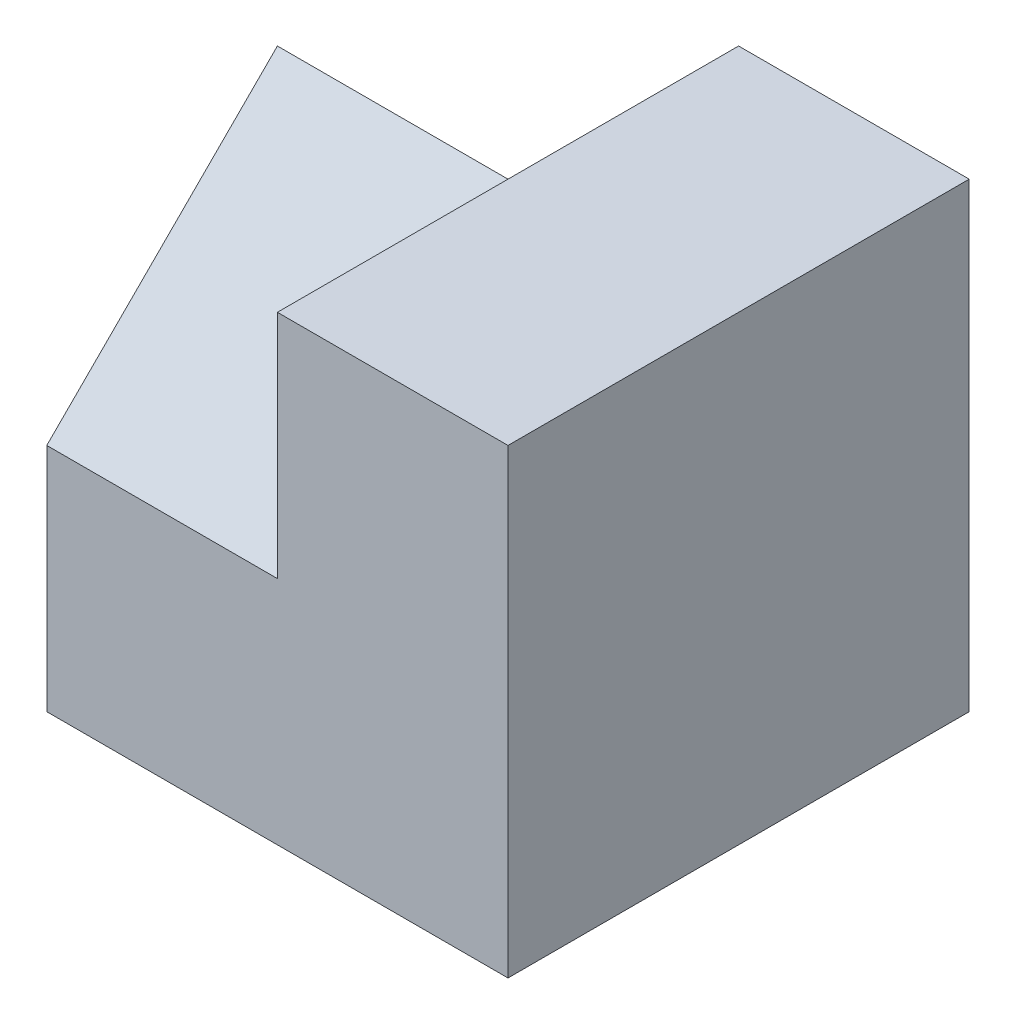
ISO-10303-21;
HEADER;
FILE_DESCRIPTION(('STEP AP214'),'2;1');
FILE_NAME('part.step','',(''),(''),'','','');
FILE_SCHEMA(('AUTOMOTIVE_DESIGN { 1 0 10303 214 1 1 1 1 }'));
ENDSEC;
DATA;
#1=APPLICATION_CONTEXT('core data for automotive mechanical design processes');
#2=APPLICATION_PROTOCOL_DEFINITION('international standard','automotive_design',2000,#1);
#3=PRODUCT_CONTEXT('',#1,'mechanical');
#4=PRODUCT('Part','Part','',(#3));
#5=PRODUCT_RELATED_PRODUCT_CATEGORY('part','',(#4));
#6=PRODUCT_DEFINITION_FORMATION('','',#4);
#7=PRODUCT_DEFINITION_CONTEXT('part definition',#1,'design');
#8=PRODUCT_DEFINITION('design','',#6,#7);
#9=PRODUCT_DEFINITION_SHAPE('','',#8);
#10=(LENGTH_UNIT() NAMED_UNIT(*) SI_UNIT(.MILLI.,.METRE.));
#11=(NAMED_UNIT(*) PLANE_ANGLE_UNIT() SI_UNIT($,.RADIAN.));
#12=(NAMED_UNIT(*) SI_UNIT($,.STERADIAN.) SOLID_ANGLE_UNIT());
#13=UNCERTAINTY_MEASURE_WITH_UNIT(LENGTH_MEASURE(1.E-05),#10,'distance_accuracy_value','');
#14=(GEOMETRIC_REPRESENTATION_CONTEXT(3) GLOBAL_UNCERTAINTY_ASSIGNED_CONTEXT((#13)) GLOBAL_UNIT_ASSIGNED_CONTEXT((#10,
#11,#12)) REPRESENTATION_CONTEXT('',''));
#15=CARTESIAN_POINT('',(0.,0.,0.));
#16=DIRECTION('',(0.,0.,1.));
#17=DIRECTION('',(1.,0.,0.));
#18=AXIS2_PLACEMENT_3D('',#15,#16,#17);
#19=CARTESIAN_POINT('',(-2.,4.,2.));
#20=DIRECTION('',(1.,0.,0.));
#21=DIRECTION('',(0.,0.,-1.));
#22=AXIS2_PLACEMENT_3D('',#19,#20,#21);
#23=PLANE('',#22);
#24=DIRECTION('',(0.,0.707106781186548,-0.707106781186548));
#25=VECTOR('',#24,1.);
#26=CARTESIAN_POINT('',(-2.,2.,2.));
#27=LINE('',#26,#25);
#28=CARTESIAN_POINT('',(-2.,2.,2.));
#29=VERTEX_POINT('',#28);
#30=CARTESIAN_POINT('',(-2.,4.,0.));
#31=VERTEX_POINT('',#30);
#32=EDGE_CURVE('E140',#29,#31,#27,.T.);
#33=ORIENTED_EDGE('',*,*,#32,.T.);
#34=DIRECTION('',(0.,-0.707106781186548,-0.707106781186548));
#35=VECTOR('',#34,1.);
#36=CARTESIAN_POINT('',(-2.,2.,-2.));
#37=LINE('',#36,#35);
#38=CARTESIAN_POINT('',(-2.,2.,-2.));
#39=VERTEX_POINT('',#38);
#40=EDGE_CURVE('E114',#31,#39,#37,.T.);
#41=ORIENTED_EDGE('',*,*,#40,.T.);
#42=DIRECTION('',(0.,-1.,0.));
#43=VECTOR('',#42,1.);
#44=CARTESIAN_POINT('',(-2.,4.,-2.));
#45=LINE('',#44,#43);
#46=CARTESIAN_POINT('',(-2.,0.,-2.));
#47=VERTEX_POINT('',#46);
#48=EDGE_CURVE('E41',#39,#47,#45,.T.);
#49=ORIENTED_EDGE('',*,*,#48,.T.);
#50=DIRECTION('',(0.,0.,1.));
#51=VECTOR('',#50,1.);
#52=CARTESIAN_POINT('',(-2.,0.,2.));
#53=LINE('',#52,#51);
#54=CARTESIAN_POINT('',(-2.,0.,2.));
#55=VERTEX_POINT('',#54);
#56=EDGE_CURVE('E88',#47,#55,#53,.T.);
#57=ORIENTED_EDGE('',*,*,#56,.T.);
#58=DIRECTION('',(0.,-1.,0.));
#59=VECTOR('',#58,1.);
#60=CARTESIAN_POINT('',(-2.,4.,2.));
#61=LINE('',#60,#59);
#62=EDGE_CURVE('E82',#29,#55,#61,.T.);
#63=ORIENTED_EDGE('',*,*,#62,.F.);
#64=EDGE_LOOP('',(#33,#41,#49,#57,#63));
#65=FACE_BOUND('',#64,.T.);
#66=ADVANCED_FACE('F33',(#65),#23,.F.);
#67=CARTESIAN_POINT('',(0.,4.,0.));
#68=DIRECTION('',(0.,-1.,0.));
#69=DIRECTION('',(0.,0.,-1.));
#70=AXIS2_PLACEMENT_3D('',#67,#68,#69);
#71=PLANE('',#70);
#72=DIRECTION('',(0.,0.,-1.));
#73=VECTOR('',#72,1.);
#74=CARTESIAN_POINT('',(0.,4.,0.));
#75=LINE('',#74,#73);
#76=CARTESIAN_POINT('',(0.,4.,2.));
#77=VERTEX_POINT('',#76);
#78=CARTESIAN_POINT('',(0.,4.,0.));
#79=VERTEX_POINT('',#78);
#80=EDGE_CURVE('E48',#77,#79,#75,.T.);
#81=ORIENTED_EDGE('',*,*,#80,.F.);
#82=DIRECTION('',(1.,0.,0.));
#83=VECTOR('',#82,1.);
#84=CARTESIAN_POINT('',(-2.,4.,2.));
#85=LINE('',#84,#83);
#86=CARTESIAN_POINT('',(2.,4.,2.));
#87=VERTEX_POINT('',#86);
#88=EDGE_CURVE('E56',#77,#87,#85,.T.);
#89=ORIENTED_EDGE('',*,*,#88,.T.);
#90=DIRECTION('',(0.,0.,-1.));
#91=VECTOR('',#90,1.);
#92=CARTESIAN_POINT('',(2.,4.,2.));
#93=LINE('',#92,#91);
#94=CARTESIAN_POINT('',(2.,4.,-2.));
#95=VERTEX_POINT('',#94);
#96=EDGE_CURVE('E87',#87,#95,#93,.T.);
#97=ORIENTED_EDGE('',*,*,#96,.T.);
#98=DIRECTION('',(-1.,0.,0.));
#99=VECTOR('',#98,1.);
#100=CARTESIAN_POINT('',(-2.,4.,-2.));
#101=LINE('',#100,#99);
#102=CARTESIAN_POINT('',(0.,4.,-2.));
#103=VERTEX_POINT('',#102);
#104=EDGE_CURVE('E120',#95,#103,#101,.T.);
#105=ORIENTED_EDGE('',*,*,#104,.T.);
#106=DIRECTION('',(0.,0.,-1.));
#107=VECTOR('',#106,1.);
#108=CARTESIAN_POINT('',(0.,4.,0.));
#109=LINE('',#108,#107);
#110=EDGE_CURVE('E134',#79,#103,#109,.T.);
#111=ORIENTED_EDGE('',*,*,#110,.F.);
#112=EDGE_LOOP('',(#81,#89,#97,#105,#111));
#113=FACE_BOUND('',#112,.T.);
#114=ADVANCED_FACE('F125',(#113),#71,.F.);
#115=CARTESIAN_POINT('',(-2.,4.,2.));
#116=DIRECTION('',(0.,0.,-1.));
#117=DIRECTION('',(-1.,0.,0.));
#118=AXIS2_PLACEMENT_3D('',#115,#116,#117);
#119=PLANE('',#118);
#120=DIRECTION('',(-1.,0.,0.));
#121=VECTOR('',#120,1.);
#122=CARTESIAN_POINT('',(0.,2.,2.));
#123=LINE('',#122,#121);
#124=CARTESIAN_POINT('',(0.,2.,2.));
#125=VERTEX_POINT('',#124);
#126=EDGE_CURVE('E132',#125,#29,#123,.T.);
#127=ORIENTED_EDGE('',*,*,#126,.T.);
#128=ORIENTED_EDGE('',*,*,#62,.T.);
#129=DIRECTION('',(1.,0.,0.));
#130=VECTOR('',#129,1.);
#131=CARTESIAN_POINT('',(-2.,0.,2.));
#132=LINE('',#131,#130);
#133=CARTESIAN_POINT('',(2.,0.,2.));
#134=VERTEX_POINT('',#133);
#135=EDGE_CURVE('E75',#55,#134,#132,.T.);
#136=ORIENTED_EDGE('',*,*,#135,.T.);
#137=DIRECTION('',(0.,-1.,0.));
#138=VECTOR('',#137,1.);
#139=CARTESIAN_POINT('',(2.,4.,2.));
#140=LINE('',#139,#138);
#141=EDGE_CURVE('E79',#87,#134,#140,.T.);
#142=ORIENTED_EDGE('',*,*,#141,.F.);
#143=ORIENTED_EDGE('',*,*,#88,.F.);
#144=DIRECTION('',(0.,1.,0.));
#145=VECTOR('',#144,1.);
#146=CARTESIAN_POINT('',(0.,0.,2.));
#147=LINE('',#146,#145);
#148=EDGE_CURVE('E144',#125,#77,#147,.T.);
#149=ORIENTED_EDGE('',*,*,#148,.F.);
#150=EDGE_LOOP('',(#127,#128,#136,#142,#143,#149));
#151=FACE_BOUND('',#150,.T.);
#152=ADVANCED_FACE('F78',(#151),#119,.F.);
#153=CARTESIAN_POINT('',(-2.,4.,-2.));
#154=DIRECTION('',(0.,0.,1.));
#155=DIRECTION('',(1.,0.,0.));
#156=AXIS2_PLACEMENT_3D('',#153,#154,#155);
#157=PLANE('',#156);
#158=DIRECTION('',(-1.,0.,0.));
#159=VECTOR('',#158,1.);
#160=CARTESIAN_POINT('',(0.,2.,-2.));
#161=LINE('',#160,#159);
#162=CARTESIAN_POINT('',(0.,2.,-2.));
#163=VERTEX_POINT('',#162);
#164=EDGE_CURVE('E98',#163,#39,#161,.T.);
#165=ORIENTED_EDGE('',*,*,#164,.F.);
#166=DIRECTION('',(0.,-1.,0.));
#167=VECTOR('',#166,1.);
#168=CARTESIAN_POINT('',(0.,0.,-2.));
#169=LINE('',#168,#167);
#170=EDGE_CURVE('E123',#103,#163,#169,.T.);
#171=ORIENTED_EDGE('',*,*,#170,.F.);
#172=ORIENTED_EDGE('',*,*,#104,.F.);
#173=DIRECTION('',(0.,-1.,0.));
#174=VECTOR('',#173,1.);
#175=CARTESIAN_POINT('',(2.,4.,-2.));
#176=LINE('',#175,#174);
#177=CARTESIAN_POINT('',(2.,0.,-2.));
#178=VERTEX_POINT('',#177);
#179=EDGE_CURVE('E11',#95,#178,#176,.T.);
#180=ORIENTED_EDGE('',*,*,#179,.T.);
#181=DIRECTION('',(-1.,0.,0.));
#182=VECTOR('',#181,1.);
#183=CARTESIAN_POINT('',(-2.,0.,-2.));
#184=LINE('',#183,#182);
#185=EDGE_CURVE('E97',#178,#47,#184,.T.);
#186=ORIENTED_EDGE('',*,*,#185,.T.);
#187=ORIENTED_EDGE('',*,*,#48,.F.);
#188=EDGE_LOOP('',(#165,#171,#172,#180,#186,#187));
#189=FACE_BOUND('',#188,.T.);
#190=ADVANCED_FACE('F117',(#189),#157,.F.);
#191=CARTESIAN_POINT('',(2.,4.,2.));
#192=DIRECTION('',(-1.,0.,0.));
#193=DIRECTION('',(0.,0.,1.));
#194=AXIS2_PLACEMENT_3D('',#191,#192,#193);
#195=PLANE('',#194);
#196=DIRECTION('',(0.,0.,-1.));
#197=VECTOR('',#196,1.);
#198=CARTESIAN_POINT('',(2.,0.,2.));
#199=LINE('',#198,#197);
#200=EDGE_CURVE('E93',#134,#178,#199,.T.);
#201=ORIENTED_EDGE('',*,*,#200,.T.);
#202=ORIENTED_EDGE('',*,*,#179,.F.);
#203=ORIENTED_EDGE('',*,*,#96,.F.);
#204=ORIENTED_EDGE('',*,*,#141,.T.);
#205=EDGE_LOOP('',(#201,#202,#203,#204));
#206=FACE_BOUND('',#205,.T.);
#207=ADVANCED_FACE('F35',(#206),#195,.F.);
#208=CARTESIAN_POINT('',(0.,0.,0.));
#209=DIRECTION('',(0.,-1.,0.));
#210=DIRECTION('',(0.,0.,-1.));
#211=AXIS2_PLACEMENT_3D('',#208,#209,#210);
#212=PLANE('',#211);
#213=ORIENTED_EDGE('',*,*,#200,.F.);
#214=ORIENTED_EDGE('',*,*,#135,.F.);
#215=ORIENTED_EDGE('',*,*,#56,.F.);
#216=ORIENTED_EDGE('',*,*,#185,.F.);
#217=EDGE_LOOP('',(#213,#214,#215,#216));
#218=FACE_BOUND('',#217,.T.);
#219=ADVANCED_FACE('F95',(#218),#212,.T.);
#220=CARTESIAN_POINT('',(0.,2.,-2.));
#221=DIRECTION('',(0.,0.707106781186547,-0.707106781186547));
#222=DIRECTION('',(0.,0.707106781186548,0.707106781186548));
#223=AXIS2_PLACEMENT_3D('',#220,#221,#222);
#224=PLANE('',#223);
#225=ORIENTED_EDGE('',*,*,#40,.F.);
#226=DIRECTION('',(-1.,0.,0.));
#227=VECTOR('',#226,1.);
#228=CARTESIAN_POINT('',(0.,4.,0.));
#229=LINE('',#228,#227);
#230=EDGE_CURVE('E102',#79,#31,#229,.T.);
#231=ORIENTED_EDGE('',*,*,#230,.F.);
#232=DIRECTION('',(0.,-0.707106781186548,-0.707106781186548));
#233=VECTOR('',#232,1.);
#234=CARTESIAN_POINT('',(0.,2.,-2.));
#235=LINE('',#234,#233);
#236=EDGE_CURVE('E131',#79,#163,#235,.T.);
#237=ORIENTED_EDGE('',*,*,#236,.T.);
#238=ORIENTED_EDGE('',*,*,#164,.T.);
#239=EDGE_LOOP('',(#225,#231,#237,#238));
#240=FACE_BOUND('',#239,.T.);
#241=ADVANCED_FACE('F158',(#240),#224,.T.);
#242=CARTESIAN_POINT('',(0.,0.,0.));
#243=DIRECTION('',(-1.,0.,0.));
#244=DIRECTION('',(0.,0.,1.));
#245=AXIS2_PLACEMENT_3D('',#242,#243,#244);
#246=PLANE('',#245);
#247=ORIENTED_EDGE('',*,*,#236,.F.);
#248=ORIENTED_EDGE('',*,*,#110,.T.);
#249=ORIENTED_EDGE('',*,*,#170,.T.);
#250=EDGE_LOOP('',(#247,#248,#249));
#251=FACE_BOUND('',#250,.T.);
#252=ADVANCED_FACE('F156',(#251),#246,.T.);
#253=CARTESIAN_POINT('',(0.,2.,2.));
#254=DIRECTION('',(0.,0.707106781186547,0.707106781186547));
#255=DIRECTION('',(0.,-0.707106781186548,0.707106781186548));
#256=AXIS2_PLACEMENT_3D('',#253,#254,#255);
#257=PLANE('',#256);
#258=ORIENTED_EDGE('',*,*,#32,.F.);
#259=ORIENTED_EDGE('',*,*,#126,.F.);
#260=DIRECTION('',(0.,0.707106781186548,-0.707106781186548));
#261=VECTOR('',#260,1.);
#262=CARTESIAN_POINT('',(0.,2.,2.));
#263=LINE('',#262,#261);
#264=EDGE_CURVE('E142',#125,#79,#263,.T.);
#265=ORIENTED_EDGE('',*,*,#264,.T.);
#266=ORIENTED_EDGE('',*,*,#230,.T.);
#267=EDGE_LOOP('',(#258,#259,#265,#266));
#268=FACE_BOUND('',#267,.T.);
#269=ADVANCED_FACE('F150',(#268),#257,.T.);
#270=CARTESIAN_POINT('',(0.,0.,0.));
#271=DIRECTION('',(-1.,0.,0.));
#272=DIRECTION('',(0.,0.,1.));
#273=AXIS2_PLACEMENT_3D('',#270,#271,#272);
#274=PLANE('',#273);
#275=ORIENTED_EDGE('',*,*,#264,.F.);
#276=ORIENTED_EDGE('',*,*,#148,.T.);
#277=ORIENTED_EDGE('',*,*,#80,.T.);
#278=EDGE_LOOP('',(#275,#276,#277));
#279=FACE_BOUND('',#278,.T.);
#280=ADVANCED_FACE('F163',(#279),#274,.T.);
#281=CLOSED_SHELL('',(#66,#114,#152,#190,#207,#219,#241,#252,#269,#280));
#282=MANIFOLD_SOLID_BREP('B2',#281);
#283=ADVANCED_BREP_SHAPE_REPRESENTATION('',(#18,#282),#14);
#284=SHAPE_DEFINITION_REPRESENTATION(#9,#283);
ENDSEC;
END-ISO-10303-21;
